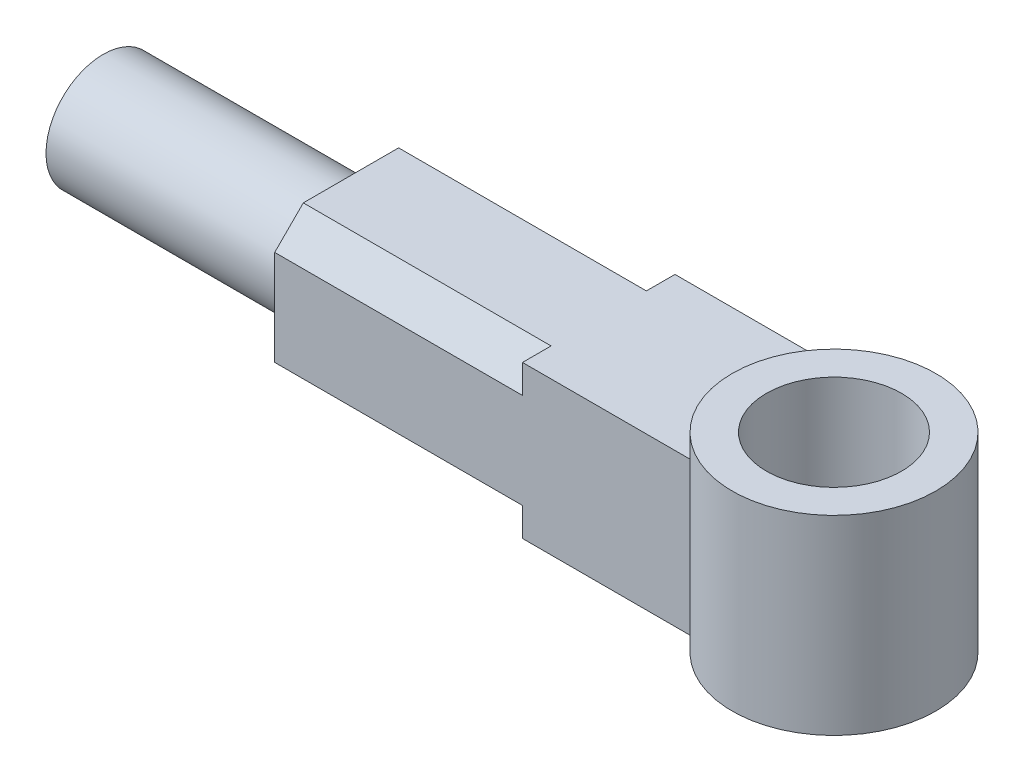
ISO-10303-21;
HEADER;
FILE_DESCRIPTION(('STEP AP214'),'2;1');
FILE_NAME('part.step','',(''),(''),'','','');
FILE_SCHEMA(('AUTOMOTIVE_DESIGN { 1 0 10303 214 1 1 1 1 }'));
ENDSEC;
DATA;
#1=APPLICATION_CONTEXT('core data for automotive mechanical design processes');
#2=APPLICATION_PROTOCOL_DEFINITION('international standard','automotive_design',2000,#1);
#3=PRODUCT_CONTEXT('',#1,'mechanical');
#4=PRODUCT('Part','Part','',(#3));
#5=PRODUCT_RELATED_PRODUCT_CATEGORY('part','',(#4));
#6=PRODUCT_DEFINITION_FORMATION('','',#4);
#7=PRODUCT_DEFINITION_CONTEXT('part definition',#1,'design');
#8=PRODUCT_DEFINITION('design','',#6,#7);
#9=PRODUCT_DEFINITION_SHAPE('','',#8);
#10=(LENGTH_UNIT() NAMED_UNIT(*) SI_UNIT(.MILLI.,.METRE.));
#11=(NAMED_UNIT(*) PLANE_ANGLE_UNIT() SI_UNIT($,.RADIAN.));
#12=(NAMED_UNIT(*) SI_UNIT($,.STERADIAN.) SOLID_ANGLE_UNIT());
#13=UNCERTAINTY_MEASURE_WITH_UNIT(LENGTH_MEASURE(1.E-05),#10,'distance_accuracy_value','');
#14=(GEOMETRIC_REPRESENTATION_CONTEXT(3) GLOBAL_UNCERTAINTY_ASSIGNED_CONTEXT((#13)) GLOBAL_UNIT_ASSIGNED_CONTEXT((#10,
#11,#12)) REPRESENTATION_CONTEXT('',''));
#15=CARTESIAN_POINT('',(0.,0.,0.));
#16=DIRECTION('',(0.,0.,1.));
#17=DIRECTION('',(1.,0.,0.));
#18=AXIS2_PLACEMENT_3D('',#15,#16,#17);
#19=CARTESIAN_POINT('',(-140.311288741493,0.,20.));
#20=DIRECTION('',(1.,0.,0.));
#21=DIRECTION('',(0.,0.,-1.));
#22=AXIS2_PLACEMENT_3D('',#19,#20,#21);
#23=PLANE('',#22);
#24=DIRECTION('',(0.,-1.,0.));
#25=VECTOR('',#24,1.);
#26=CARTESIAN_POINT('',(-140.311288741493,0.,-20.));
#27=LINE('',#26,#25);
#28=CARTESIAN_POINT('',(-140.311288741493,12.5,-20.));
#29=VERTEX_POINT('',#28);
#30=CARTESIAN_POINT('',(-140.311288741493,-12.4999999999998,-20.0000000000002));
#31=VERTEX_POINT('',#30);
#32=EDGE_CURVE('E161',#29,#31,#27,.T.);
#33=ORIENTED_EDGE('',*,*,#32,.T.);
#34=DIRECTION('',(0.,0.707106781186552,-0.707106781186543));
#35=VECTOR('',#34,1.);
#36=CARTESIAN_POINT('',(-140.311288741493,-12.4999999999998,-20.0000000000002));
#37=LINE('',#36,#35);
#38=CARTESIAN_POINT('',(-140.311288741493,-19.9999999999999,-12.5000000000002));
#39=VERTEX_POINT('',#38);
#40=EDGE_CURVE('E187',#39,#31,#37,.T.);
#41=ORIENTED_EDGE('',*,*,#40,.F.);
#42=DIRECTION('',(0.,0.,-1.));
#43=VECTOR('',#42,1.);
#44=CARTESIAN_POINT('',(-140.311288741493,-20.,20.));
#45=LINE('',#44,#43);
#46=CARTESIAN_POINT('',(-140.311288741493,-20.,12.5));
#47=VERTEX_POINT('',#46);
#48=EDGE_CURVE('E175',#47,#39,#45,.T.);
#49=ORIENTED_EDGE('',*,*,#48,.F.);
#50=DIRECTION('',(0.,-0.70710678118655,-0.707106781186545));
#51=VECTOR('',#50,1.);
#52=CARTESIAN_POINT('',(-140.311288741493,-20.,12.5));
#53=LINE('',#52,#51);
#54=CARTESIAN_POINT('',(-140.311288741493,-12.5,20.));
#55=VERTEX_POINT('',#54);
#56=EDGE_CURVE('E211',#55,#47,#53,.T.);
#57=ORIENTED_EDGE('',*,*,#56,.F.);
#58=DIRECTION('',(0.,-1.,0.));
#59=VECTOR('',#58,1.);
#60=CARTESIAN_POINT('',(-140.311288741493,0.,20.));
#61=LINE('',#60,#59);
#62=CARTESIAN_POINT('',(-140.311288741493,12.5,20.));
#63=VERTEX_POINT('',#62);
#64=EDGE_CURVE('E180',#63,#55,#61,.T.);
#65=ORIENTED_EDGE('',*,*,#64,.F.);
#66=DIRECTION('',(0.,-0.707106781186547,0.707106781186548));
#67=VECTOR('',#66,1.);
#68=CARTESIAN_POINT('',(-140.311288741493,12.5,20.));
#69=LINE('',#68,#67);
#70=CARTESIAN_POINT('',(-140.311288741493,20.,12.5));
#71=VERTEX_POINT('',#70);
#72=EDGE_CURVE('E232',#71,#63,#69,.T.);
#73=ORIENTED_EDGE('',*,*,#72,.F.);
#74=DIRECTION('',(0.,0.,-1.));
#75=VECTOR('',#74,1.);
#76=CARTESIAN_POINT('',(-140.311288741493,20.,20.));
#77=LINE('',#76,#75);
#78=CARTESIAN_POINT('',(-140.311288741493,20.,-12.5));
#79=VERTEX_POINT('',#78);
#80=EDGE_CURVE('E179',#71,#79,#77,.T.);
#81=ORIENTED_EDGE('',*,*,#80,.T.);
#82=DIRECTION('',(0.,0.70710678118655,0.707106781186545));
#83=VECTOR('',#82,1.);
#84=CARTESIAN_POINT('',(-140.311288741493,20.,-12.5));
#85=LINE('',#84,#83);
#86=EDGE_CURVE('E258',#29,#79,#85,.T.);
#87=ORIENTED_EDGE('',*,*,#86,.F.);
#88=EDGE_LOOP('',(#33,#41,#49,#57,#65,#73,#81,#87));
#89=FACE_BOUND('',#88,.T.);
#90=CARTESIAN_POINT('',(-140.311288741493,0.,0.));
#91=DIRECTION('',(1.,0.,0.));
#92=DIRECTION('',(0.,0.,-1.));
#93=AXIS2_PLACEMENT_3D('',#90,#91,#92);
#94=CIRCLE('',#93,15.);
#95=CARTESIAN_POINT('',(-140.311288741493,0.,-15.));
#96=VERTEX_POINT('',#95);
#97=EDGE_CURVE('E59',#96,#96,#94,.F.);
#98=ORIENTED_EDGE('',*,*,#97,.F.);
#99=EDGE_LOOP('',(#98));
#100=FACE_BOUND('',#99,.T.);
#101=ADVANCED_FACE('F49',(#89,#100),#23,.F.);
#102=CARTESIAN_POINT('',(0.,-20.,20.));
#103=DIRECTION('',(0.,-1.,0.));
#104=DIRECTION('',(1.,0.,0.));
#105=AXIS2_PLACEMENT_3D('',#102,#103,#104);
#106=PLANE('',#105);
#107=CARTESIAN_POINT('',(-13.5890665192705,-20.,0.));
#108=DIRECTION('',(0.,-1.,0.));
#109=DIRECTION('',(1.,0.,0.));
#110=AXIS2_PLACEMENT_3D('',#107,#108,#109);
#111=CIRCLE('',#110,26.7222222222222);
#112=CARTESIAN_POINT('',(-31.3112887414927,-20.,20.));
#113=VERTEX_POINT('',#112);
#114=CARTESIAN_POINT('',(-31.3112887414927,-20.,-20.));
#115=VERTEX_POINT('',#114);
#116=EDGE_CURVE('E138',#113,#115,#111,.T.);
#117=ORIENTED_EDGE('',*,*,#116,.F.);
#118=DIRECTION('',(-1.,0.,0.));
#119=VECTOR('',#118,1.);
#120=CARTESIAN_POINT('',(0.,-20.,20.));
#121=LINE('',#120,#119);
#122=CARTESIAN_POINT('',(-75.3112887414927,-20.,20.));
#123=VERTEX_POINT('',#122);
#124=EDGE_CURVE('E169',#113,#123,#121,.T.);
#125=ORIENTED_EDGE('',*,*,#124,.T.);
#126=DIRECTION('',(0.,0.,1.));
#127=VECTOR('',#126,1.);
#128=CARTESIAN_POINT('',(-75.3112887414927,-20.,12.5));
#129=LINE('',#128,#127);
#130=CARTESIAN_POINT('',(-75.3112887414927,-20.,12.5));
#131=VERTEX_POINT('',#130);
#132=EDGE_CURVE('E222',#131,#123,#129,.T.);
#133=ORIENTED_EDGE('',*,*,#132,.F.);
#134=DIRECTION('',(-1.,0.,0.));
#135=VECTOR('',#134,1.);
#136=CARTESIAN_POINT('',(-75.3112887414927,-20.,12.5));
#137=LINE('',#136,#135);
#138=EDGE_CURVE('E228',#131,#47,#137,.T.);
#139=ORIENTED_EDGE('',*,*,#138,.T.);
#140=ORIENTED_EDGE('',*,*,#48,.T.);
#141=DIRECTION('',(-1.,0.,0.));
#142=VECTOR('',#141,1.);
#143=CARTESIAN_POINT('',(-75.3112887414927,-19.9999999999999,-12.5000000000002));
#144=LINE('',#143,#142);
#145=CARTESIAN_POINT('',(-75.3112887414927,-19.9999999999999,-12.5000000000002));
#146=VERTEX_POINT('',#145);
#147=EDGE_CURVE('E205',#146,#39,#144,.T.);
#148=ORIENTED_EDGE('',*,*,#147,.F.);
#149=DIRECTION('',(0.,0.,1.));
#150=VECTOR('',#149,1.);
#151=CARTESIAN_POINT('',(-75.3112887414927,-19.9999999999998,-20.0000000000002));
#152=LINE('',#151,#150);
#153=CARTESIAN_POINT('',(-75.3112887414927,-19.9999999999998,-20.0000000000002));
#154=VERTEX_POINT('',#153);
#155=EDGE_CURVE('E192',#154,#146,#152,.T.);
#156=ORIENTED_EDGE('',*,*,#155,.F.);
#157=DIRECTION('',(-1.,0.,0.));
#158=VECTOR('',#157,1.);
#159=CARTESIAN_POINT('',(0.,-20.,-20.));
#160=LINE('',#159,#158);
#161=EDGE_CURVE('E162',#115,#154,#160,.T.);
#162=ORIENTED_EDGE('',*,*,#161,.F.);
#163=EDGE_LOOP('',(#117,#125,#133,#139,#140,#148,#156,#162));
#164=FACE_BOUND('',#163,.T.);
#165=ADVANCED_FACE('F51',(#164),#106,.T.);
#166=CARTESIAN_POINT('',(0.,20.,20.));
#167=DIRECTION('',(0.,-1.,0.));
#168=DIRECTION('',(1.,0.,0.));
#169=AXIS2_PLACEMENT_3D('',#166,#167,#168);
#170=PLANE('',#169);
#171=DIRECTION('',(-1.,0.,0.));
#172=VECTOR('',#171,1.);
#173=CARTESIAN_POINT('',(0.,20.,20.));
#174=LINE('',#173,#172);
#175=CARTESIAN_POINT('',(-31.3112887414927,20.,20.));
#176=VERTEX_POINT('',#175);
#177=CARTESIAN_POINT('',(-75.3112887414927,19.9999999999999,20.));
#178=VERTEX_POINT('',#177);
#179=EDGE_CURVE('E151',#176,#178,#174,.T.);
#180=ORIENTED_EDGE('',*,*,#179,.F.);
#181=CARTESIAN_POINT('',(-13.5890665192705,20.,0.));
#182=DIRECTION('',(0.,-1.,0.));
#183=DIRECTION('',(1.,0.,0.));
#184=AXIS2_PLACEMENT_3D('',#181,#182,#183);
#185=CIRCLE('',#184,26.7222222222222);
#186=CARTESIAN_POINT('',(-31.3112887414927,20.,-20.));
#187=VERTEX_POINT('',#186);
#188=EDGE_CURVE('E135',#176,#187,#185,.T.);
#189=ORIENTED_EDGE('',*,*,#188,.T.);
#190=DIRECTION('',(-1.,0.,0.));
#191=VECTOR('',#190,1.);
#192=CARTESIAN_POINT('',(0.,20.,-20.));
#193=LINE('',#192,#191);
#194=CARTESIAN_POINT('',(-75.3112887414927,20.,-20.));
#195=VERTEX_POINT('',#194);
#196=EDGE_CURVE('E148',#187,#195,#193,.T.);
#197=ORIENTED_EDGE('',*,*,#196,.T.);
#198=DIRECTION('',(0.,0.,-1.));
#199=VECTOR('',#198,1.);
#200=CARTESIAN_POINT('',(-75.3112887414927,20.,-12.5));
#201=LINE('',#200,#199);
#202=CARTESIAN_POINT('',(-75.3112887414927,20.,-12.5));
#203=VERTEX_POINT('',#202);
#204=EDGE_CURVE('E265',#203,#195,#201,.T.);
#205=ORIENTED_EDGE('',*,*,#204,.F.);
#206=DIRECTION('',(-1.,0.,0.));
#207=VECTOR('',#206,1.);
#208=CARTESIAN_POINT('',(-75.3112887414927,20.,-12.5));
#209=LINE('',#208,#207);
#210=EDGE_CURVE('E171',#203,#79,#209,.T.);
#211=ORIENTED_EDGE('',*,*,#210,.T.);
#212=ORIENTED_EDGE('',*,*,#80,.F.);
#213=DIRECTION('',(-1.,0.,0.));
#214=VECTOR('',#213,1.);
#215=CARTESIAN_POINT('',(-75.3112887414927,20.,12.5));
#216=LINE('',#215,#214);
#217=CARTESIAN_POINT('',(-75.3112887414927,20.,12.5));
#218=VERTEX_POINT('',#217);
#219=EDGE_CURVE('E245',#218,#71,#216,.T.);
#220=ORIENTED_EDGE('',*,*,#219,.F.);
#221=DIRECTION('',(0.,0.,-1.));
#222=VECTOR('',#221,1.);
#223=CARTESIAN_POINT('',(-75.3112887414927,19.9999999999999,20.));
#224=LINE('',#223,#222);
#225=EDGE_CURVE('E235',#178,#218,#224,.T.);
#226=ORIENTED_EDGE('',*,*,#225,.F.);
#227=EDGE_LOOP('',(#180,#189,#197,#205,#211,#212,#220,#226));
#228=FACE_BOUND('',#227,.T.);
#229=ADVANCED_FACE('F146',(#228),#170,.F.);
#230=CARTESIAN_POINT('',(0.,0.,20.));
#231=DIRECTION('',(0.,0.,1.));
#232=DIRECTION('',(1.,0.,0.));
#233=AXIS2_PLACEMENT_3D('',#230,#231,#232);
#234=PLANE('',#233);
#235=DIRECTION('',(0.,-1.,0.));
#236=VECTOR('',#235,1.);
#237=CARTESIAN_POINT('',(-31.3112887414927,0.,20.));
#238=LINE('',#237,#236);
#239=EDGE_CURVE('E185',#176,#113,#238,.T.);
#240=ORIENTED_EDGE('',*,*,#239,.F.);
#241=ORIENTED_EDGE('',*,*,#179,.T.);
#242=DIRECTION('',(0.,1.,0.));
#243=VECTOR('',#242,1.);
#244=CARTESIAN_POINT('',(-75.3112887414927,12.5,20.));
#245=LINE('',#244,#243);
#246=CARTESIAN_POINT('',(-75.3112887414927,12.5,20.));
#247=VERTEX_POINT('',#246);
#248=EDGE_CURVE('E242',#247,#178,#245,.T.);
#249=ORIENTED_EDGE('',*,*,#248,.F.);
#250=DIRECTION('',(-1.,0.,0.));
#251=VECTOR('',#250,1.);
#252=CARTESIAN_POINT('',(-75.3112887414927,12.5,20.));
#253=LINE('',#252,#251);
#254=EDGE_CURVE('E248',#247,#63,#253,.T.);
#255=ORIENTED_EDGE('',*,*,#254,.T.);
#256=ORIENTED_EDGE('',*,*,#64,.T.);
#257=DIRECTION('',(-1.,0.,0.));
#258=VECTOR('',#257,1.);
#259=CARTESIAN_POINT('',(-75.3112887414927,-12.5,20.));
#260=LINE('',#259,#258);
#261=CARTESIAN_POINT('',(-75.3112887414927,-12.5,20.));
#262=VERTEX_POINT('',#261);
#263=EDGE_CURVE('E225',#262,#55,#260,.T.);
#264=ORIENTED_EDGE('',*,*,#263,.F.);
#265=DIRECTION('',(0.,1.,0.));
#266=VECTOR('',#265,1.);
#267=CARTESIAN_POINT('',(-75.3112887414927,-20.,20.));
#268=LINE('',#267,#266);
#269=EDGE_CURVE('E214',#123,#262,#268,.T.);
#270=ORIENTED_EDGE('',*,*,#269,.F.);
#271=ORIENTED_EDGE('',*,*,#124,.F.);
#272=EDGE_LOOP('',(#240,#241,#249,#255,#256,#264,#270,#271));
#273=FACE_BOUND('',#272,.T.);
#274=ADVANCED_FACE('F288',(#273),#234,.T.);
#275=CARTESIAN_POINT('',(0.,0.,-20.));
#276=DIRECTION('',(0.,0.,1.));
#277=DIRECTION('',(1.,0.,0.));
#278=AXIS2_PLACEMENT_3D('',#275,#276,#277);
#279=PLANE('',#278);
#280=ORIENTED_EDGE('',*,*,#196,.F.);
#281=DIRECTION('',(0.,-1.,0.));
#282=VECTOR('',#281,1.);
#283=CARTESIAN_POINT('',(-31.3112887414927,0.,-20.));
#284=LINE('',#283,#282);
#285=EDGE_CURVE('E12',#187,#115,#284,.T.);
#286=ORIENTED_EDGE('',*,*,#285,.T.);
#287=ORIENTED_EDGE('',*,*,#161,.T.);
#288=DIRECTION('',(0.,-1.,0.));
#289=VECTOR('',#288,1.);
#290=CARTESIAN_POINT('',(-75.3112887414927,-12.4999999999998,-20.0000000000002));
#291=LINE('',#290,#289);
#292=CARTESIAN_POINT('',(-75.3112887414927,-12.4999999999998,-20.));
#293=VERTEX_POINT('',#292);
#294=EDGE_CURVE('E203',#293,#154,#291,.T.);
#295=ORIENTED_EDGE('',*,*,#294,.F.);
#296=DIRECTION('',(-1.,0.,0.));
#297=VECTOR('',#296,1.);
#298=CARTESIAN_POINT('',(-75.3112887414927,-12.4999999999998,-20.0000000000002));
#299=LINE('',#298,#297);
#300=EDGE_CURVE('E207',#293,#31,#299,.T.);
#301=ORIENTED_EDGE('',*,*,#300,.T.);
#302=ORIENTED_EDGE('',*,*,#32,.F.);
#303=DIRECTION('',(-1.,0.,0.));
#304=VECTOR('',#303,1.);
#305=CARTESIAN_POINT('',(-75.3112887414927,12.5,-20.));
#306=LINE('',#305,#304);
#307=CARTESIAN_POINT('',(-75.3112887414927,12.5,-20.));
#308=VERTEX_POINT('',#307);
#309=EDGE_CURVE('E268',#308,#29,#306,.T.);
#310=ORIENTED_EDGE('',*,*,#309,.F.);
#311=DIRECTION('',(0.,-1.,0.));
#312=VECTOR('',#311,1.);
#313=CARTESIAN_POINT('',(-75.3112887414927,20.,-20.));
#314=LINE('',#313,#312);
#315=EDGE_CURVE('E159',#195,#308,#314,.T.);
#316=ORIENTED_EDGE('',*,*,#315,.F.);
#317=EDGE_LOOP('',(#280,#286,#287,#295,#301,#302,#310,#316));
#318=FACE_BOUND('',#317,.T.);
#319=ADVANCED_FACE('F156',(#318),#279,.F.);
#320=CARTESIAN_POINT('',(-75.3112887414927,20.,-12.5));
#321=DIRECTION('',(0.,-0.707106781186545,0.70710678118655));
#322=DIRECTION('',(0.,-0.70710678118655,-0.707106781186545));
#323=AXIS2_PLACEMENT_3D('',#320,#321,#322);
#324=PLANE('',#323);
#325=ORIENTED_EDGE('',*,*,#86,.T.);
#326=ORIENTED_EDGE('',*,*,#210,.F.);
#327=DIRECTION('',(0.,0.70710678118655,0.707106781186545));
#328=VECTOR('',#327,1.);
#329=CARTESIAN_POINT('',(-75.3112887414927,20.,-12.5));
#330=LINE('',#329,#328);
#331=EDGE_CURVE('E261',#308,#203,#330,.T.);
#332=ORIENTED_EDGE('',*,*,#331,.F.);
#333=ORIENTED_EDGE('',*,*,#309,.T.);
#334=EDGE_LOOP('',(#325,#326,#332,#333));
#335=FACE_BOUND('',#334,.T.);
#336=ADVANCED_FACE('F337',(#335),#324,.F.);
#337=CARTESIAN_POINT('',(-75.3112887414927,0.,0.));
#338=DIRECTION('',(1.,0.,0.));
#339=DIRECTION('',(0.,0.,-1.));
#340=AXIS2_PLACEMENT_3D('',#337,#338,#339);
#341=PLANE('',#340);
#342=ORIENTED_EDGE('',*,*,#315,.T.);
#343=ORIENTED_EDGE('',*,*,#331,.T.);
#344=ORIENTED_EDGE('',*,*,#204,.T.);
#345=EDGE_LOOP('',(#342,#343,#344));
#346=FACE_BOUND('',#345,.T.);
#347=ADVANCED_FACE('F341',(#346),#341,.F.);
#348=CARTESIAN_POINT('',(-205.311288741493,0.,0.));
#349=DIRECTION('',(1.,0.,0.));
#350=DIRECTION('',(0.,0.,-1.));
#351=AXIS2_PLACEMENT_3D('',#348,#349,#350);
#352=CYLINDRICAL_SURFACE('',#351,15.);
#353=CARTESIAN_POINT('',(-205.311288741493,0.,0.));
#354=DIRECTION('',(-1.,0.,0.));
#355=DIRECTION('',(0.,0.,1.));
#356=AXIS2_PLACEMENT_3D('',#353,#354,#355);
#357=CIRCLE('',#356,15.);
#358=CARTESIAN_POINT('',(-205.311288741493,0.,15.));
#359=VERTEX_POINT('',#358);
#360=EDGE_CURVE('E252',#359,#359,#357,.T.);
#361=ORIENTED_EDGE('',*,*,#360,.F.);
#362=EDGE_LOOP('',(#361));
#363=FACE_BOUND('',#362,.T.);
#364=ORIENTED_EDGE('',*,*,#97,.T.);
#365=EDGE_LOOP('',(#364));
#366=FACE_BOUND('',#365,.T.);
#367=ADVANCED_FACE('F320',(#363,#366),#352,.T.);
#368=CARTESIAN_POINT('',(-205.311288741493,0.,0.));
#369=DIRECTION('',(-1.,0.,0.));
#370=DIRECTION('',(0.,0.,1.));
#371=AXIS2_PLACEMENT_3D('',#368,#369,#370);
#372=PLANE('',#371);
#373=ORIENTED_EDGE('',*,*,#360,.T.);
#374=EDGE_LOOP('',(#373));
#375=FACE_BOUND('',#374,.T.);
#376=ADVANCED_FACE('F313',(#375),#372,.T.);
#377=CARTESIAN_POINT('',(-75.3112887414927,12.5,20.));
#378=DIRECTION('',(0.,-0.707106781186548,-0.707106781186547));
#379=DIRECTION('',(0.,0.707106781186547,-0.707106781186548));
#380=AXIS2_PLACEMENT_3D('',#377,#378,#379);
#381=PLANE('',#380);
#382=ORIENTED_EDGE('',*,*,#72,.T.);
#383=ORIENTED_EDGE('',*,*,#254,.F.);
#384=DIRECTION('',(0.,-0.707106781186547,0.707106781186548));
#385=VECTOR('',#384,1.);
#386=CARTESIAN_POINT('',(-75.3112887414927,12.5,20.));
#387=LINE('',#386,#385);
#388=EDGE_CURVE('E239',#218,#247,#387,.T.);
#389=ORIENTED_EDGE('',*,*,#388,.F.);
#390=ORIENTED_EDGE('',*,*,#219,.T.);
#391=EDGE_LOOP('',(#382,#383,#389,#390));
#392=FACE_BOUND('',#391,.T.);
#393=ADVANCED_FACE('F311',(#392),#381,.F.);
#394=CARTESIAN_POINT('',(-75.3112887414927,0.,0.));
#395=DIRECTION('',(1.,0.,0.));
#396=DIRECTION('',(0.,1.,0.));
#397=AXIS2_PLACEMENT_3D('',#394,#395,#396);
#398=PLANE('',#397);
#399=ORIENTED_EDGE('',*,*,#225,.T.);
#400=ORIENTED_EDGE('',*,*,#388,.T.);
#401=ORIENTED_EDGE('',*,*,#248,.T.);
#402=EDGE_LOOP('',(#399,#400,#401));
#403=FACE_BOUND('',#402,.T.);
#404=ADVANCED_FACE('F308',(#403),#398,.F.);
#405=CARTESIAN_POINT('',(-75.3112887414927,-20.,12.5));
#406=DIRECTION('',(0.,0.707106781186545,-0.70710678118655));
#407=DIRECTION('',(0.,0.70710678118655,0.707106781186545));
#408=AXIS2_PLACEMENT_3D('',#405,#406,#407);
#409=PLANE('',#408);
#410=ORIENTED_EDGE('',*,*,#56,.T.);
#411=ORIENTED_EDGE('',*,*,#138,.F.);
#412=DIRECTION('',(0.,-0.70710678118655,-0.707106781186545));
#413=VECTOR('',#412,1.);
#414=CARTESIAN_POINT('',(-75.3112887414927,-20.,12.5));
#415=LINE('',#414,#413);
#416=EDGE_CURVE('E218',#262,#131,#415,.T.);
#417=ORIENTED_EDGE('',*,*,#416,.F.);
#418=ORIENTED_EDGE('',*,*,#263,.T.);
#419=EDGE_LOOP('',(#410,#411,#417,#418));
#420=FACE_BOUND('',#419,.T.);
#421=ADVANCED_FACE('F300',(#420),#409,.F.);
#422=CARTESIAN_POINT('',(-75.3112887414927,0.,0.));
#423=DIRECTION('',(1.,0.,0.));
#424=DIRECTION('',(0.,0.,1.));
#425=AXIS2_PLACEMENT_3D('',#422,#423,#424);
#426=PLANE('',#425);
#427=ORIENTED_EDGE('',*,*,#269,.T.);
#428=ORIENTED_EDGE('',*,*,#416,.T.);
#429=ORIENTED_EDGE('',*,*,#132,.T.);
#430=EDGE_LOOP('',(#427,#428,#429));
#431=FACE_BOUND('',#430,.T.);
#432=ADVANCED_FACE('F306',(#431),#426,.F.);
#433=CARTESIAN_POINT('',(-75.3112887414927,-12.4999999999998,-20.0000000000002));
#434=DIRECTION('',(0.,0.707106781186543,0.707106781186552));
#435=DIRECTION('',(0.,-0.707106781186552,0.707106781186543));
#436=AXIS2_PLACEMENT_3D('',#433,#434,#435);
#437=PLANE('',#436);
#438=ORIENTED_EDGE('',*,*,#40,.T.);
#439=ORIENTED_EDGE('',*,*,#300,.F.);
#440=DIRECTION('',(0.,0.707106781186552,-0.707106781186543));
#441=VECTOR('',#440,1.);
#442=CARTESIAN_POINT('',(-75.3112887414927,-12.4999999999998,-20.0000000000002));
#443=LINE('',#442,#441);
#444=EDGE_CURVE('E66',#146,#293,#443,.T.);
#445=ORIENTED_EDGE('',*,*,#444,.F.);
#446=ORIENTED_EDGE('',*,*,#147,.T.);
#447=EDGE_LOOP('',(#438,#439,#445,#446));
#448=FACE_BOUND('',#447,.T.);
#449=ADVANCED_FACE('F386',(#448),#437,.F.);
#450=CARTESIAN_POINT('',(-75.3112887414927,0.,0.));
#451=DIRECTION('',(1.,0.,0.));
#452=DIRECTION('',(0.,-1.,0.));
#453=AXIS2_PLACEMENT_3D('',#450,#451,#452);
#454=PLANE('',#453);
#455=ORIENTED_EDGE('',*,*,#155,.T.);
#456=ORIENTED_EDGE('',*,*,#444,.T.);
#457=ORIENTED_EDGE('',*,*,#294,.T.);
#458=EDGE_LOOP('',(#455,#456,#457));
#459=FACE_BOUND('',#458,.T.);
#460=ADVANCED_FACE('F395',(#459),#454,.F.);
#461=CARTESIAN_POINT('',(-13.5890665192705,-25.,0.));
#462=DIRECTION('',(0.,1.,0.));
#463=DIRECTION('',(-1.,0.,0.));
#464=AXIS2_PLACEMENT_3D('',#461,#462,#463);
#465=CYLINDRICAL_SURFACE('',#464,26.7222222222222);
#466=CARTESIAN_POINT('',(-13.5890665192705,25.,0.));
#467=DIRECTION('',(0.,1.,0.));
#468=DIRECTION('',(-1.,0.,0.));
#469=AXIS2_PLACEMENT_3D('',#466,#467,#468);
#470=CIRCLE('',#469,26.7222222222222);
#471=CARTESIAN_POINT('',(-40.3112887414928,25.,0.));
#472=VERTEX_POINT('',#471);
#473=EDGE_CURVE('E450',#472,#472,#470,.T.);
#474=ORIENTED_EDGE('',*,*,#473,.F.);
#475=EDGE_LOOP('',(#474));
#476=FACE_BOUND('',#475,.T.);
#477=CARTESIAN_POINT('',(-13.5890665192705,-25.,0.));
#478=DIRECTION('',(0.,1.,0.));
#479=DIRECTION('',(-1.,0.,0.));
#480=AXIS2_PLACEMENT_3D('',#477,#478,#479);
#481=CIRCLE('',#480,26.7222222222222);
#482=CARTESIAN_POINT('',(-40.3112887414927,-25.,0.));
#483=VERTEX_POINT('',#482);
#484=EDGE_CURVE('E153',#483,#483,#481,.T.);
#485=ORIENTED_EDGE('',*,*,#484,.T.);
#486=EDGE_LOOP('',(#485));
#487=FACE_BOUND('',#486,.T.);
#488=ORIENTED_EDGE('',*,*,#239,.T.);
#489=ORIENTED_EDGE('',*,*,#116,.T.);
#490=ORIENTED_EDGE('',*,*,#285,.F.);
#491=ORIENTED_EDGE('',*,*,#188,.F.);
#492=EDGE_LOOP('',(#488,#489,#490,#491));
#493=FACE_BOUND('',#492,.T.);
#494=ADVANCED_FACE('F134',(#476,#487,#493),#465,.T.);
#495=CARTESIAN_POINT('',(-13.5890665192705,-25.,0.));
#496=DIRECTION('',(0.,1.,0.));
#497=DIRECTION('',(-1.,0.,0.));
#498=AXIS2_PLACEMENT_3D('',#495,#496,#497);
#499=PLANE('',#498);
#500=CARTESIAN_POINT('',(-13.5890665192705,-25.,0.));
#501=DIRECTION('',(0.,1.,0.));
#502=DIRECTION('',(-1.,0.,0.));
#503=AXIS2_PLACEMENT_3D('',#500,#501,#502);
#504=CIRCLE('',#503,17.7222222222222);
#505=CARTESIAN_POINT('',(-31.3112887414927,-25.,0.));
#506=VERTEX_POINT('',#505);
#507=EDGE_CURVE('E460',#506,#506,#504,.T.);
#508=ORIENTED_EDGE('',*,*,#507,.T.);
#509=EDGE_LOOP('',(#508));
#510=FACE_BOUND('',#509,.T.);
#511=ORIENTED_EDGE('',*,*,#484,.F.);
#512=EDGE_LOOP('',(#511));
#513=FACE_BOUND('',#512,.T.);
#514=ADVANCED_FACE('F413',(#510,#513),#499,.F.);
#515=CARTESIAN_POINT('',(-13.5890665192705,-25.,0.));
#516=DIRECTION('',(0.,1.,0.));
#517=DIRECTION('',(-1.,0.,0.));
#518=AXIS2_PLACEMENT_3D('',#515,#516,#517);
#519=CYLINDRICAL_SURFACE('',#518,17.7222222222222);
#520=CARTESIAN_POINT('',(-13.5890665192705,25.,0.));
#521=DIRECTION('',(0.,1.,0.));
#522=DIRECTION('',(-1.,0.,0.));
#523=AXIS2_PLACEMENT_3D('',#520,#521,#522);
#524=CIRCLE('',#523,17.7222222222222);
#525=CARTESIAN_POINT('',(-31.3112887414927,25.,0.));
#526=VERTEX_POINT('',#525);
#527=EDGE_CURVE('E453',#526,#526,#524,.T.);
#528=CARTESIAN_POINT('',(-31.3112887414927,-25.,0.));
#529=CARTESIAN_POINT('',(-31.3112887414927,-24.4791666666666,0.));
#530=CARTESIAN_POINT('',(-31.3112887414927,-23.9583333333333,0.));
#531=CARTESIAN_POINT('',(-31.3112887414927,-22.9166666666666,0.));
#532=CARTESIAN_POINT('',(-31.3112887414927,-22.3958333333333,0.));
#533=CARTESIAN_POINT('',(-31.3112887414927,-21.3541666666666,0.));
#534=CARTESIAN_POINT('',(-31.3112887414927,-20.8333333333333,0.));
#535=CARTESIAN_POINT('',(-31.3112887414927,-19.7916666666666,0.));
#536=CARTESIAN_POINT('',(-31.3112887414927,-19.2708333333333,0.));
#537=CARTESIAN_POINT('',(-31.3112887414927,-18.2291666666666,0.));
#538=CARTESIAN_POINT('',(-31.3112887414927,-17.7083333333333,0.));
#539=CARTESIAN_POINT('',(-31.3112887414927,-16.6666666666666,0.));
#540=CARTESIAN_POINT('',(-31.3112887414927,-16.1458333333333,0.));
#541=CARTESIAN_POINT('',(-31.3112887414927,-15.1041666666666,0.));
#542=CARTESIAN_POINT('',(-31.3112887414927,-14.5833333333333,0.));
#543=CARTESIAN_POINT('',(-31.3112887414927,-13.5416666666666,0.));
#544=CARTESIAN_POINT('',(-31.3112887414927,-13.0208333333333,0.));
#545=CARTESIAN_POINT('',(-31.3112887414927,-11.9791666666666,0.));
#546=CARTESIAN_POINT('',(-31.3112887414927,-11.4583333333333,0.));
#547=CARTESIAN_POINT('',(-31.3112887414927,-10.4166666666666,0.));
#548=CARTESIAN_POINT('',(-31.3112887414927,-9.89583333333331,0.));
#549=CARTESIAN_POINT('',(-31.3112887414927,-8.85416666666664,0.));
#550=CARTESIAN_POINT('',(-31.3112887414927,-8.33333333333331,0.));
#551=CARTESIAN_POINT('',(-31.3112887414927,-7.29166666666665,0.));
#552=CARTESIAN_POINT('',(-31.3112887414927,-6.77083333333332,0.));
#553=CARTESIAN_POINT('',(-31.3112887414927,-5.72916666666665,0.));
#554=CARTESIAN_POINT('',(-31.3112887414927,-5.20833333333331,0.));
#555=CARTESIAN_POINT('',(-31.3112887414927,-4.16666666666665,0.));
#556=CARTESIAN_POINT('',(-31.3112887414927,-3.64583333333331,0.));
#557=CARTESIAN_POINT('',(-31.3112887414927,-2.60416666666665,0.));
#558=CARTESIAN_POINT('',(-31.3112887414927,-2.08333333333332,0.));
#559=CARTESIAN_POINT('',(-31.3112887414927,-1.04166666666665,0.));
#560=CARTESIAN_POINT('',(-31.3112887414927,-0.520833333333316,0.));
#561=CARTESIAN_POINT('',(-31.3112887414927,0.520833333333351,0.));
#562=CARTESIAN_POINT('',(-31.3112887414927,1.04166666666669,0.));
#563=CARTESIAN_POINT('',(-31.3112887414927,2.08333333333335,0.));
#564=CARTESIAN_POINT('',(-31.3112887414927,2.60416666666668,0.));
#565=CARTESIAN_POINT('',(-31.3112887414927,3.64583333333335,0.));
#566=CARTESIAN_POINT('',(-31.3112887414927,4.16666666666668,0.));
#567=CARTESIAN_POINT('',(-31.3112887414927,5.20833333333335,0.));
#568=CARTESIAN_POINT('',(-31.3112887414927,5.72916666666668,0.));
#569=CARTESIAN_POINT('',(-31.3112887414927,6.77083333333335,0.));
#570=CARTESIAN_POINT('',(-31.3112887414927,7.29166666666668,0.));
#571=CARTESIAN_POINT('',(-31.3112887414927,8.33333333333335,0.));
#572=CARTESIAN_POINT('',(-31.3112887414927,8.85416666666668,0.));
#573=CARTESIAN_POINT('',(-31.3112887414927,9.89583333333334,0.));
#574=CARTESIAN_POINT('',(-31.3112887414927,10.4166666666667,0.));
#575=CARTESIAN_POINT('',(-31.3112887414927,11.4583333333333,0.));
#576=CARTESIAN_POINT('',(-31.3112887414927,11.9791666666667,0.));
#577=CARTESIAN_POINT('',(-31.3112887414927,13.0208333333333,0.));
#578=CARTESIAN_POINT('',(-31.3112887414927,13.5416666666667,0.));
#579=CARTESIAN_POINT('',(-31.3112887414927,14.5833333333333,0.));
#580=CARTESIAN_POINT('',(-31.3112887414927,15.1041666666667,0.));
#581=CARTESIAN_POINT('',(-31.3112887414927,16.1458333333333,0.));
#582=CARTESIAN_POINT('',(-31.3112887414927,16.6666666666667,0.));
#583=CARTESIAN_POINT('',(-31.3112887414927,17.7083333333333,0.));
#584=CARTESIAN_POINT('',(-31.3112887414927,18.2291666666667,0.));
#585=CARTESIAN_POINT('',(-31.3112887414927,19.2708333333333,0.));
#586=CARTESIAN_POINT('',(-31.3112887414927,19.7916666666667,0.));
#587=CARTESIAN_POINT('',(-31.3112887414927,20.8333333333333,0.));
#588=CARTESIAN_POINT('',(-31.3112887414927,21.3541666666667,0.));
#589=CARTESIAN_POINT('',(-31.3112887414927,22.3958333333333,0.));
#590=CARTESIAN_POINT('',(-31.3112887414927,22.9166666666667,0.));
#591=CARTESIAN_POINT('',(-31.3112887414927,23.9583333333333,0.));
#592=CARTESIAN_POINT('',(-31.3112887414927,24.4791666666667,0.));
#593=CARTESIAN_POINT('',(-31.3112887414927,25.,0.));
#594=B_SPLINE_CURVE_WITH_KNOTS('',3,(#528,#529,#530,#531,#532,#533,#534,#535,#536,#537,#538,
#539,#540,#541,#542,#543,#544,#545,#546,#547,#548,#549,#550,#551,#552,#553,#554,#555,#556,#557,
#558,#559,#560,#561,#562,#563,#564,#565,#566,#567,#568,#569,#570,#571,#572,#573,#574,#575,#576,
#577,#578,#579,#580,#581,#582,#583,#584,#585,#586,#587,#588,#589,#590,#591,#592,#593),
.UNSPECIFIED.,.F.,.F.,(4,2,2,2,2,2,2,2,2,2,2,2,2,2,2,2,2,2,2,2,2,2,2,2,2,2,2,2,2,2,2,2,4),(0.,
1.5625,3.125,4.6875,6.25,7.8125,9.375,10.9375,12.5,14.0625,15.625,17.1875,18.75,20.3125,21.875,
23.4375,25.,26.5625,28.125,29.6875,31.25,32.8125,34.375,35.9375,37.5,39.0625,40.625,42.1875,
43.75,45.3125,46.875,48.4375,50.),.UNSPECIFIED.);
#595=EDGE_CURVE('BSEAM423',#506,#526,#594,.T.);
#596=ORIENTED_EDGE('',*,*,#507,.F.);
#597=ORIENTED_EDGE('',*,*,#527,.T.);
#598=ORIENTED_EDGE('',*,*,#595,.T.);
#599=ORIENTED_EDGE('',*,*,#595,.F.);
#600=EDGE_LOOP('',(#596,#598,#597,#599));
#601=FACE_BOUND('',#600,.T.);
#602=ADVANCED_FACE('F423',(#601),#519,.F.);
#603=CARTESIAN_POINT('',(-13.5890665192705,25.,0.));
#604=DIRECTION('',(0.,1.,0.));
#605=DIRECTION('',(-1.,0.,0.));
#606=AXIS2_PLACEMENT_3D('',#603,#604,#605);
#607=PLANE('',#606);
#608=ORIENTED_EDGE('',*,*,#473,.T.);
#609=EDGE_LOOP('',(#608));
#610=FACE_BOUND('',#609,.T.);
#611=ORIENTED_EDGE('',*,*,#527,.F.);
#612=EDGE_LOOP('',(#611));
#613=FACE_BOUND('',#612,.T.);
#614=ADVANCED_FACE('F433',(#610,#613),#607,.T.);
#615=CLOSED_SHELL('',(#101,#165,#229,#274,#319,#336,#347,#367,#376,#393,#404,#421,#432,#449,
#460,#494,#514,#602,#614));
#616=MANIFOLD_SOLID_BREP('B2',#615);
#617=ADVANCED_BREP_SHAPE_REPRESENTATION('',(#18,#616),#14);
#618=SHAPE_DEFINITION_REPRESENTATION(#9,#617);
ENDSEC;
END-ISO-10303-21;
